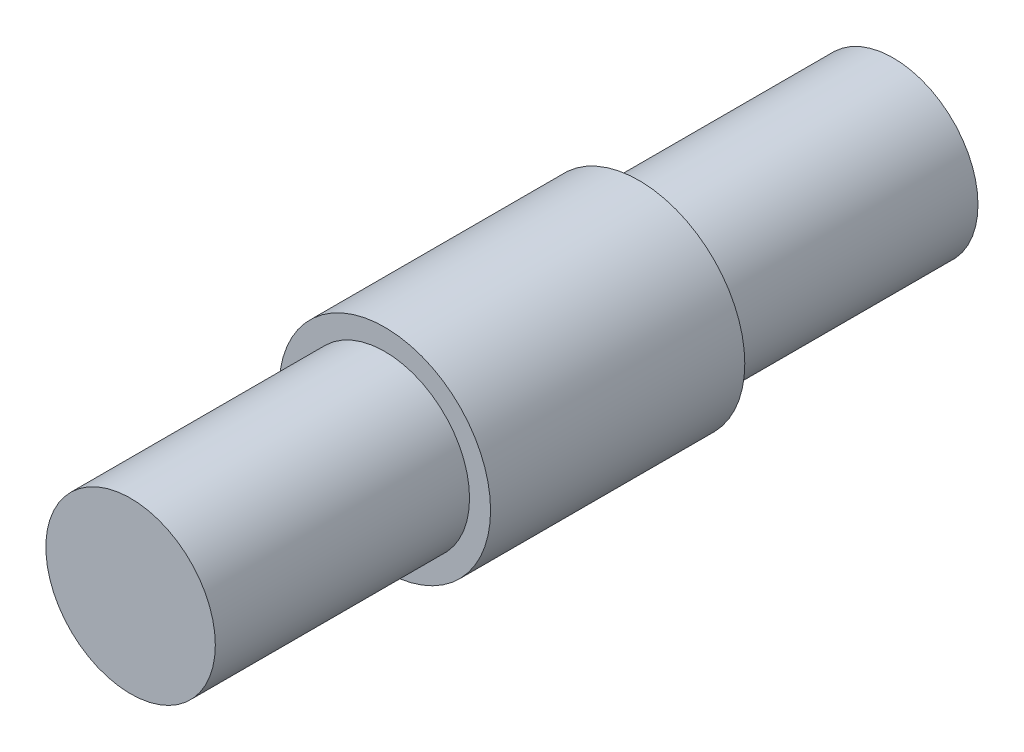
ISO-10303-21;
HEADER;
FILE_DESCRIPTION(('STEP AP214'),'2;1');
FILE_NAME('part.step','',(''),(''),'','','');
FILE_SCHEMA(('AUTOMOTIVE_DESIGN { 1 0 10303 214 1 1 1 1 }'));
ENDSEC;
DATA;
#1=APPLICATION_CONTEXT('core data for automotive mechanical design processes');
#2=APPLICATION_PROTOCOL_DEFINITION('international standard','automotive_design',2000,#1);
#3=PRODUCT_CONTEXT('',#1,'mechanical');
#4=PRODUCT('Part','Part','',(#3));
#5=PRODUCT_RELATED_PRODUCT_CATEGORY('part','',(#4));
#6=PRODUCT_DEFINITION_FORMATION('','',#4);
#7=PRODUCT_DEFINITION_CONTEXT('part definition',#1,'design');
#8=PRODUCT_DEFINITION('design','',#6,#7);
#9=PRODUCT_DEFINITION_SHAPE('','',#8);
#10=(LENGTH_UNIT() NAMED_UNIT(*) SI_UNIT(.MILLI.,.METRE.));
#11=(NAMED_UNIT(*) PLANE_ANGLE_UNIT() SI_UNIT($,.RADIAN.));
#12=(NAMED_UNIT(*) SI_UNIT($,.STERADIAN.) SOLID_ANGLE_UNIT());
#13=UNCERTAINTY_MEASURE_WITH_UNIT(LENGTH_MEASURE(1.E-05),#10,'distance_accuracy_value','');
#14=(GEOMETRIC_REPRESENTATION_CONTEXT(3) GLOBAL_UNCERTAINTY_ASSIGNED_CONTEXT((#13)) GLOBAL_UNIT_ASSIGNED_CONTEXT((#10,
#11,#12)) REPRESENTATION_CONTEXT('',''));
#15=CARTESIAN_POINT('',(0.,0.,0.));
#16=DIRECTION('',(0.,0.,1.));
#17=DIRECTION('',(1.,0.,0.));
#18=AXIS2_PLACEMENT_3D('',#15,#16,#17);
#19=CARTESIAN_POINT('',(0.,0.,4.7625));
#20=DIRECTION('',(0.,0.,-1.));
#21=DIRECTION('',(-1.,0.,0.));
#22=AXIS2_PLACEMENT_3D('',#19,#20,#21);
#23=CYLINDRICAL_SURFACE('',#22,3.9624);
#24=CARTESIAN_POINT('',(0.,0.,4.7625));
#25=DIRECTION('',(0.,0.,1.));
#26=DIRECTION('',(1.,0.,0.));
#27=AXIS2_PLACEMENT_3D('',#24,#25,#26);
#28=CIRCLE('',#27,3.9624);
#29=CARTESIAN_POINT('',(3.9624,0.,4.7625));
#30=VERTEX_POINT('',#29);
#31=EDGE_CURVE('E40',#30,#30,#28,.T.);
#32=ORIENTED_EDGE('',*,*,#31,.F.);
#33=EDGE_LOOP('',(#32));
#34=FACE_BOUND('',#33,.T.);
#35=CARTESIAN_POINT('',(0.,0.,-4.7625));
#36=DIRECTION('',(0.,0.,1.));
#37=DIRECTION('',(1.,0.,0.));
#38=AXIS2_PLACEMENT_3D('',#35,#36,#37);
#39=CIRCLE('',#38,3.9624);
#40=CARTESIAN_POINT('',(3.9624,0.,-4.7625));
#41=VERTEX_POINT('',#40);
#42=EDGE_CURVE('E44',#41,#41,#39,.T.);
#43=ORIENTED_EDGE('',*,*,#42,.T.);
#44=EDGE_LOOP('',(#43));
#45=FACE_BOUND('',#44,.T.);
#46=ADVANCED_FACE('F34',(#34,#45),#23,.T.);
#47=CARTESIAN_POINT('',(0.,0.,4.7625));
#48=DIRECTION('',(0.,0.,1.));
#49=DIRECTION('',(1.,0.,0.));
#50=AXIS2_PLACEMENT_3D('',#47,#48,#49);
#51=PLANE('',#50);
#52=CARTESIAN_POINT('',(0.,0.,4.7625));
#53=DIRECTION('',(0.,0.,1.));
#54=DIRECTION('',(1.,0.,0.));
#55=AXIS2_PLACEMENT_3D('',#52,#53,#54);
#56=CIRCLE('',#55,3.175);
#57=CARTESIAN_POINT('',(3.175,0.,4.7625));
#58=VERTEX_POINT('',#57);
#59=EDGE_CURVE('E49',#58,#58,#56,.F.);
#60=ORIENTED_EDGE('',*,*,#59,.T.);
#61=EDGE_LOOP('',(#60));
#62=FACE_BOUND('',#61,.T.);
#63=ORIENTED_EDGE('',*,*,#31,.T.);
#64=EDGE_LOOP('',(#63));
#65=FACE_BOUND('',#64,.T.);
#66=ADVANCED_FACE('F78',(#62,#65),#51,.T.);
#67=CARTESIAN_POINT('',(0.,0.,-4.7625));
#68=DIRECTION('',(0.,0.,1.));
#69=DIRECTION('',(1.,0.,0.));
#70=AXIS2_PLACEMENT_3D('',#67,#68,#69);
#71=PLANE('',#70);
#72=CARTESIAN_POINT('',(0.,0.,-4.7625));
#73=DIRECTION('',(0.,0.,1.));
#74=DIRECTION('',(1.,0.,0.));
#75=AXIS2_PLACEMENT_3D('',#72,#73,#74);
#76=CIRCLE('',#75,3.175);
#77=CARTESIAN_POINT('',(3.175,0.,-4.7625));
#78=VERTEX_POINT('',#77);
#79=EDGE_CURVE('E10',#78,#78,#76,.F.);
#80=ORIENTED_EDGE('',*,*,#79,.F.);
#81=EDGE_LOOP('',(#80));
#82=FACE_BOUND('',#81,.T.);
#83=ORIENTED_EDGE('',*,*,#42,.F.);
#84=EDGE_LOOP('',(#83));
#85=FACE_BOUND('',#84,.T.);
#86=ADVANCED_FACE('F83',(#82,#85),#71,.F.);
#87=CARTESIAN_POINT('',(0.,0.,-14.2875));
#88=DIRECTION('',(0.,0.,1.));
#89=DIRECTION('',(1.,0.,0.));
#90=AXIS2_PLACEMENT_3D('',#87,#88,#89);
#91=PLANE('',#90);
#92=CARTESIAN_POINT('',(0.,0.,-14.2875));
#93=DIRECTION('',(0.,0.,1.));
#94=DIRECTION('',(1.,0.,0.));
#95=AXIS2_PLACEMENT_3D('',#92,#93,#94);
#96=CIRCLE('',#95,3.175);
#97=CARTESIAN_POINT('',(3.175,0.,-14.2875));
#98=VERTEX_POINT('',#97);
#99=EDGE_CURVE('E54',#98,#98,#96,.T.);
#100=ORIENTED_EDGE('',*,*,#99,.F.);
#101=EDGE_LOOP('',(#100));
#102=FACE_BOUND('',#101,.T.);
#103=ADVANCED_FACE('F72',(#102),#91,.F.);
#104=CARTESIAN_POINT('',(0.,0.,14.2875));
#105=DIRECTION('',(0.,0.,-1.));
#106=DIRECTION('',(-1.,0.,0.));
#107=AXIS2_PLACEMENT_3D('',#104,#105,#106);
#108=CYLINDRICAL_SURFACE('',#107,3.175);
#109=ORIENTED_EDGE('',*,*,#99,.T.);
#110=EDGE_LOOP('',(#109));
#111=FACE_BOUND('',#110,.T.);
#112=ORIENTED_EDGE('',*,*,#79,.T.);
#113=EDGE_LOOP('',(#112));
#114=FACE_BOUND('',#113,.T.);
#115=ADVANCED_FACE('F64',(#111,#114),#108,.T.);
#116=ORIENTED_EDGE('',*,*,#59,.F.);
#117=EDGE_LOOP('',(#116));
#118=FACE_BOUND('',#117,.T.);
#119=CARTESIAN_POINT('',(0.,0.,14.2875));
#120=DIRECTION('',(0.,0.,1.));
#121=DIRECTION('',(1.,0.,0.));
#122=AXIS2_PLACEMENT_3D('',#119,#120,#121);
#123=CIRCLE('',#122,3.175);
#124=CARTESIAN_POINT('',(3.175,0.,14.2875));
#125=VERTEX_POINT('',#124);
#126=EDGE_CURVE('E53',#125,#125,#123,.T.);
#127=ORIENTED_EDGE('',*,*,#126,.F.);
#128=EDGE_LOOP('',(#127));
#129=FACE_BOUND('',#128,.T.);
#130=ADVANCED_FACE('F62',(#118,#129),#108,.T.);
#131=CARTESIAN_POINT('',(0.,0.,14.2875));
#132=DIRECTION('',(0.,0.,1.));
#133=DIRECTION('',(1.,0.,0.));
#134=AXIS2_PLACEMENT_3D('',#131,#132,#133);
#135=PLANE('',#134);
#136=ORIENTED_EDGE('',*,*,#126,.T.);
#137=EDGE_LOOP('',(#136));
#138=FACE_BOUND('',#137,.T.);
#139=ADVANCED_FACE('F60',(#138),#135,.T.);
#140=CLOSED_SHELL('',(#46,#66,#86,#103,#115,#130,#139));
#141=MANIFOLD_SOLID_BREP('B2',#140);
#142=ADVANCED_BREP_SHAPE_REPRESENTATION('',(#18,#141),#14);
#143=SHAPE_DEFINITION_REPRESENTATION(#9,#142);
ENDSEC;
END-ISO-10303-21;
